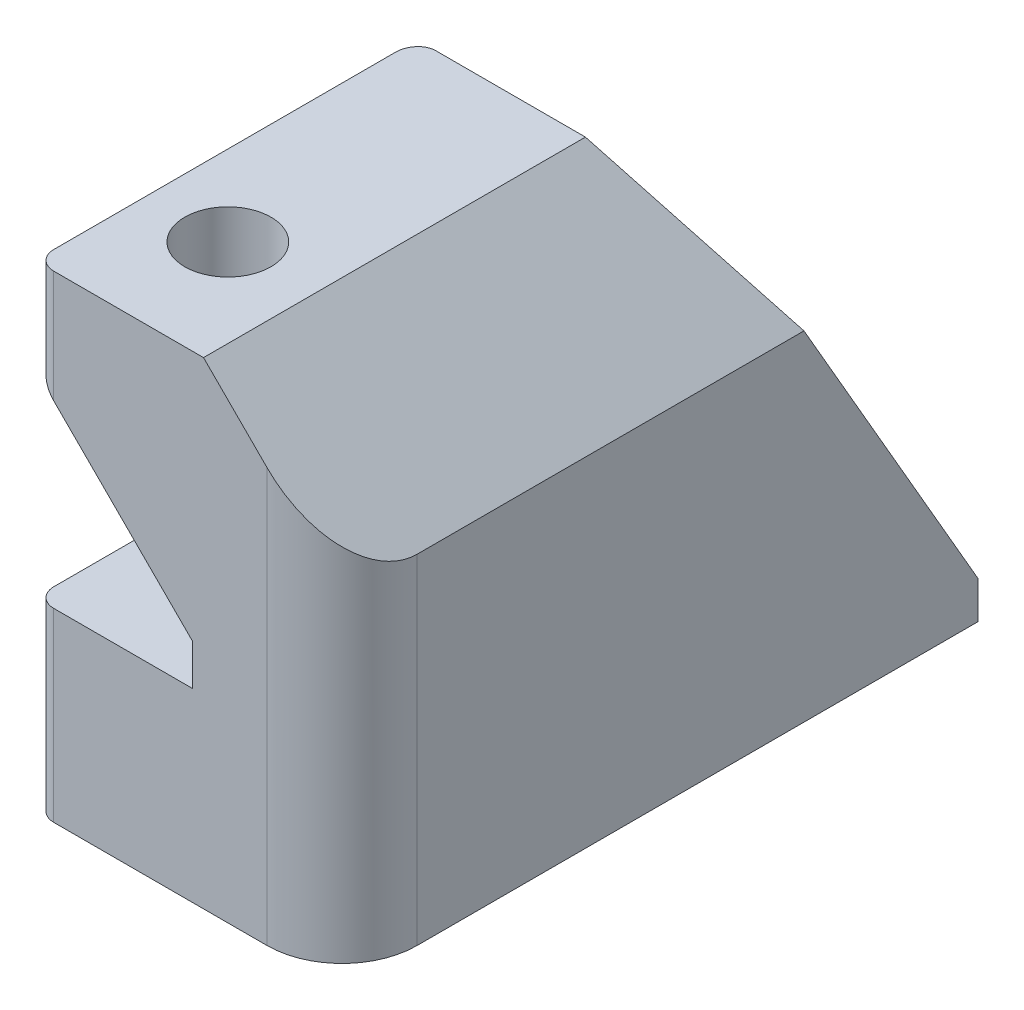
ISO-10303-21;
HEADER;
FILE_DESCRIPTION(('STEP AP214'),'2;1');
FILE_NAME('part.step','',(''),(''),'','','');
FILE_SCHEMA(('AUTOMOTIVE_DESIGN { 1 0 10303 214 1 1 1 1 }'));
ENDSEC;
DATA;
#1=APPLICATION_CONTEXT('core data for automotive mechanical design processes');
#2=APPLICATION_PROTOCOL_DEFINITION('international standard','automotive_design',2000,#1);
#3=PRODUCT_CONTEXT('',#1,'mechanical');
#4=PRODUCT('Part','Part','',(#3));
#5=PRODUCT_RELATED_PRODUCT_CATEGORY('part','',(#4));
#6=PRODUCT_DEFINITION_FORMATION('','',#4);
#7=PRODUCT_DEFINITION_CONTEXT('part definition',#1,'design');
#8=PRODUCT_DEFINITION('design','',#6,#7);
#9=PRODUCT_DEFINITION_SHAPE('','',#8);
#10=(LENGTH_UNIT() NAMED_UNIT(*) SI_UNIT(.MILLI.,.METRE.));
#11=(NAMED_UNIT(*) PLANE_ANGLE_UNIT() SI_UNIT($,.RADIAN.));
#12=(NAMED_UNIT(*) SI_UNIT($,.STERADIAN.) SOLID_ANGLE_UNIT());
#13=UNCERTAINTY_MEASURE_WITH_UNIT(LENGTH_MEASURE(1.E-05),#10,'distance_accuracy_value','');
#14=(GEOMETRIC_REPRESENTATION_CONTEXT(3) GLOBAL_UNCERTAINTY_ASSIGNED_CONTEXT((#13)) GLOBAL_UNIT_ASSIGNED_CONTEXT((#10,
#11,#12)) REPRESENTATION_CONTEXT('',''));
#15=CARTESIAN_POINT('',(0.,0.,0.));
#16=DIRECTION('',(0.,0.,1.));
#17=DIRECTION('',(1.,0.,0.));
#18=AXIS2_PLACEMENT_3D('',#15,#16,#17);
#19=CARTESIAN_POINT('',(0.,0.,-46.39999966));
#20=DIRECTION('',(0.,-1.,0.));
#21=DIRECTION('',(0.,0.,-1.));
#22=AXIS2_PLACEMENT_3D('',#19,#20,#21);
#23=PLANE('',#22);
#24=CARTESIAN_POINT('',(22.3,0.,-15.4065152237886));
#25=DIRECTION('',(0.,-1.,0.));
#26=DIRECTION('',(0.,0.,-1.));
#27=AXIS2_PLACEMENT_3D('',#24,#25,#26);
#28=ELLIPSE('',#27,0.577350269189628,0.5);
#29=CARTESIAN_POINT('',(22.3,0.,-15.9838654929782));
#30=VERTEX_POINT('',#29);
#31=CARTESIAN_POINT('',(21.8,0.,-15.4065152237886));
#32=VERTEX_POINT('',#31);
#33=EDGE_CURVE('E69',#30,#32,#28,.F.);
#34=ORIENTED_EDGE('',*,*,#33,.F.);
#35=DIRECTION('',(-1.,0.,0.));
#36=VECTOR('',#35,1.);
#37=CARTESIAN_POINT('',(0.,0.,-15.9838654929782));
#38=LINE('',#37,#36);
#39=CARTESIAN_POINT('',(30.,0.,-15.9838654929782));
#40=VERTEX_POINT('',#39);
#41=EDGE_CURVE('E182',#40,#30,#38,.T.);
#42=ORIENTED_EDGE('',*,*,#41,.F.);
#43=DIRECTION('',(0.,0.,1.));
#44=VECTOR('',#43,1.);
#45=CARTESIAN_POINT('',(30.,0.,-46.39999966));
#46=LINE('',#45,#44);
#47=CARTESIAN_POINT('',(30.,0.,-1.));
#48=VERTEX_POINT('',#47);
#49=EDGE_CURVE('E237',#40,#48,#46,.T.);
#50=ORIENTED_EDGE('',*,*,#49,.T.);
#51=CARTESIAN_POINT('',(28.,0.,-1.));
#52=DIRECTION('',(0.,-1.,0.));
#53=DIRECTION('',(0.,0.,-1.));
#54=AXIS2_PLACEMENT_3D('',#51,#52,#53);
#55=CIRCLE('',#54,2.);
#56=CARTESIAN_POINT('',(28.,0.,1.));
#57=VERTEX_POINT('',#56);
#58=EDGE_CURVE('E194',#48,#57,#55,.T.);
#59=ORIENTED_EDGE('',*,*,#58,.T.);
#60=DIRECTION('',(1.,0.,0.));
#61=VECTOR('',#60,1.);
#62=CARTESIAN_POINT('',(0.,0.,1.));
#63=LINE('',#62,#61);
#64=CARTESIAN_POINT('',(22.3,0.,1.));
#65=VERTEX_POINT('',#64);
#66=EDGE_CURVE('E40',#65,#57,#63,.T.);
#67=ORIENTED_EDGE('',*,*,#66,.F.);
#68=CARTESIAN_POINT('',(22.3,0.,0.5));
#69=DIRECTION('',(0.,-1.,0.));
#70=DIRECTION('',(0.,0.,-1.));
#71=AXIS2_PLACEMENT_3D('',#68,#69,#70);
#72=CIRCLE('',#71,0.5);
#73=CARTESIAN_POINT('',(21.8,0.,0.5));
#74=VERTEX_POINT('',#73);
#75=EDGE_CURVE('E12',#74,#65,#72,.F.);
#76=ORIENTED_EDGE('',*,*,#75,.F.);
#77=DIRECTION('',(0.,0.,1.));
#78=VECTOR('',#77,1.);
#79=CARTESIAN_POINT('',(21.8,0.,-46.39999966));
#80=LINE('',#79,#78);
#81=EDGE_CURVE('E46',#32,#74,#80,.T.);
#82=ORIENTED_EDGE('',*,*,#81,.F.);
#83=EDGE_LOOP('',(#34,#42,#50,#59,#67,#76,#82));
#84=FACE_BOUND('',#83,.T.);
#85=CARTESIAN_POINT('',(23.9499998314252,0.,-2.00000000000001));
#86=DIRECTION('',(0.,1.,0.));
#87=DIRECTION('',(0.,0.,1.));
#88=AXIS2_PLACEMENT_3D('',#85,#86,#87);
#89=CIRCLE('',#88,1.15);
#90=CARTESIAN_POINT('',(23.9499998314252,0.,-0.850000000000011));
#91=VERTEX_POINT('',#90);
#92=EDGE_CURVE('E191',#91,#91,#89,.T.);
#93=ORIENTED_EDGE('',*,*,#92,.T.);
#94=EDGE_LOOP('',(#93));
#95=FACE_BOUND('',#94,.T.);
#96=ADVANCED_FACE('F37',(#84,#95),#23,.T.);
#97=CARTESIAN_POINT('',(0.,0.,1.));
#98=DIRECTION('',(0.,0.,1.));
#99=DIRECTION('',(1.,0.,0.));
#100=AXIS2_PLACEMENT_3D('',#97,#98,#99);
#101=PLANE('',#100);
#102=DIRECTION('',(0.,-1.,0.));
#103=VECTOR('',#102,1.);
#104=CARTESIAN_POINT('',(22.3,0.,1.));
#105=LINE('',#104,#103);
#106=CARTESIAN_POINT('',(22.3,4.95,1.));
#107=VERTEX_POINT('',#106);
#108=EDGE_CURVE('E55',#107,#65,#105,.T.);
#109=ORIENTED_EDGE('',*,*,#108,.T.);
#110=ORIENTED_EDGE('',*,*,#66,.T.);
#111=DIRECTION('',(0.,1.,0.));
#112=VECTOR('',#111,1.);
#113=CARTESIAN_POINT('',(28.,0.,1.));
#114=LINE('',#113,#112);
#115=CARTESIAN_POINT('',(28.,11.05,1.));
#116=VERTEX_POINT('',#115);
#117=EDGE_CURVE('E218',#57,#116,#114,.T.);
#118=ORIENTED_EDGE('',*,*,#117,.T.);
#119=DIRECTION('',(0.707106781186548,-0.707106781186548,0.));
#120=VECTOR('',#119,1.);
#121=CARTESIAN_POINT('',(26.3,12.75,1.));
#122=LINE('',#121,#120);
#123=CARTESIAN_POINT('',(26.3,12.75,1.));
#124=VERTEX_POINT('',#123);
#125=EDGE_CURVE('E186',#124,#116,#122,.T.);
#126=ORIENTED_EDGE('',*,*,#125,.F.);
#127=DIRECTION('',(-1.,0.,0.));
#128=VECTOR('',#127,1.);
#129=CARTESIAN_POINT('',(0.,12.75,1.));
#130=LINE('',#129,#128);
#131=CARTESIAN_POINT('',(22.3,12.75,1.));
#132=VERTEX_POINT('',#131);
#133=EDGE_CURVE('E215',#124,#132,#130,.T.);
#134=ORIENTED_EDGE('',*,*,#133,.T.);
#135=DIRECTION('',(0.,-1.,0.));
#136=VECTOR('',#135,1.);
#137=CARTESIAN_POINT('',(22.3,0.,1.));
#138=LINE('',#137,#136);
#139=CARTESIAN_POINT('',(22.3,9.74999999999999,1.));
#140=VERTEX_POINT('',#139);
#141=EDGE_CURVE('E214',#132,#140,#138,.T.);
#142=ORIENTED_EDGE('',*,*,#141,.T.);
#143=DIRECTION('',(0.707106781186549,-0.707106781186547,0.));
#144=VECTOR('',#143,1.);
#145=CARTESIAN_POINT('',(16.025,16.025,1.));
#146=LINE('',#145,#144);
#147=CARTESIAN_POINT('',(26.,6.05,1.));
#148=VERTEX_POINT('',#147);
#149=EDGE_CURVE('E212',#140,#148,#146,.T.);
#150=ORIENTED_EDGE('',*,*,#149,.T.);
#151=DIRECTION('',(0.,-1.,0.));
#152=VECTOR('',#151,1.);
#153=CARTESIAN_POINT('',(26.,0.,1.));
#154=LINE('',#153,#152);
#155=CARTESIAN_POINT('',(26.,4.95,1.));
#156=VERTEX_POINT('',#155);
#157=EDGE_CURVE('E209',#148,#156,#154,.T.);
#158=ORIENTED_EDGE('',*,*,#157,.T.);
#159=DIRECTION('',(-1.,0.,0.));
#160=VECTOR('',#159,1.);
#161=CARTESIAN_POINT('',(0.,4.94999999999999,1.));
#162=LINE('',#161,#160);
#163=EDGE_CURVE('E206',#156,#107,#162,.T.);
#164=ORIENTED_EDGE('',*,*,#163,.T.);
#165=EDGE_LOOP('',(#109,#110,#118,#126,#134,#142,#150,#158,#164));
#166=FACE_BOUND('',#165,.T.);
#167=ADVANCED_FACE('F285',(#166),#101,.T.);
#168=CARTESIAN_POINT('',(21.8,4.95,-46.39999966));
#169=DIRECTION('',(-1.,0.,0.));
#170=DIRECTION('',(0.,0.,1.));
#171=AXIS2_PLACEMENT_3D('',#168,#169,#170);
#172=PLANE('',#171);
#173=DIRECTION('',(0.,0.866025403784436,0.500000000000005));
#174=VECTOR('',#173,1.);
#175=CARTESIAN_POINT('',(21.8,0.749999999999996,-15.550852791086));
#176=LINE('',#175,#174);
#177=CARTESIAN_POINT('',(21.8,4.95,-13.1259816604895));
#178=VERTEX_POINT('',#177);
#179=CARTESIAN_POINT('',(21.8,1.,-15.4065152237886));
#180=VERTEX_POINT('',#179);
#181=EDGE_CURVE('E158',#178,#180,#176,.F.);
#182=ORIENTED_EDGE('',*,*,#181,.T.);
#183=DIRECTION('',(0.,1.,0.));
#184=VECTOR('',#183,1.);
#185=CARTESIAN_POINT('',(21.8,-9.,-15.4065152237886));
#186=LINE('',#185,#184);
#187=EDGE_CURVE('E265',#32,#180,#186,.T.);
#188=ORIENTED_EDGE('',*,*,#187,.F.);
#189=ORIENTED_EDGE('',*,*,#81,.T.);
#190=DIRECTION('',(0.,-1.,0.));
#191=VECTOR('',#190,1.);
#192=CARTESIAN_POINT('',(21.8,4.95,0.5));
#193=LINE('',#192,#191);
#194=CARTESIAN_POINT('',(21.8,4.95,0.5));
#195=VERTEX_POINT('',#194);
#196=EDGE_CURVE('E208',#74,#195,#193,.F.);
#197=ORIENTED_EDGE('',*,*,#196,.T.);
#198=DIRECTION('',(0.,0.,1.));
#199=VECTOR('',#198,1.);
#200=CARTESIAN_POINT('',(21.8,4.95,-46.39999966));
#201=LINE('',#200,#199);
#202=EDGE_CURVE('E233',#178,#195,#201,.T.);
#203=ORIENTED_EDGE('',*,*,#202,.F.);
#204=EDGE_LOOP('',(#182,#188,#189,#197,#203));
#205=FACE_BOUND('',#204,.T.);
#206=ADVANCED_FACE('F287',(#205),#172,.T.);
#207=CARTESIAN_POINT('',(26.,4.95,-46.39999966));
#208=DIRECTION('',(0.,1.,0.));
#209=DIRECTION('',(-1.,0.,0.));
#210=AXIS2_PLACEMENT_3D('',#207,#208,#209);
#211=PLANE('',#210);
#212=ORIENTED_EDGE('',*,*,#202,.T.);
#213=CARTESIAN_POINT('',(22.3,4.95,0.5));
#214=DIRECTION('',(0.,1.,0.));
#215=DIRECTION('',(-1.,0.,0.));
#216=AXIS2_PLACEMENT_3D('',#213,#214,#215);
#217=CIRCLE('',#216,0.5);
#218=EDGE_CURVE('E164',#195,#107,#217,.T.);
#219=ORIENTED_EDGE('',*,*,#218,.T.);
#220=ORIENTED_EDGE('',*,*,#163,.F.);
#221=DIRECTION('',(0.,0.,1.));
#222=VECTOR('',#221,1.);
#223=CARTESIAN_POINT('',(26.,4.95,-46.39999966));
#224=LINE('',#223,#222);
#225=CARTESIAN_POINT('',(26.,4.95,-13.7033319296791));
#226=VERTEX_POINT('',#225);
#227=EDGE_CURVE('E163',#226,#156,#224,.T.);
#228=ORIENTED_EDGE('',*,*,#227,.F.);
#229=DIRECTION('',(1.,0.,0.));
#230=VECTOR('',#229,1.);
#231=CARTESIAN_POINT('',(26.,4.95,-13.7033319296791));
#232=LINE('',#231,#230);
#233=CARTESIAN_POINT('',(22.3,4.95,-13.7033319296791));
#234=VERTEX_POINT('',#233);
#235=EDGE_CURVE('E170',#234,#226,#232,.T.);
#236=ORIENTED_EDGE('',*,*,#235,.F.);
#237=CARTESIAN_POINT('',(22.3,4.95,-13.1259816604895));
#238=DIRECTION('',(0.,1.,0.));
#239=DIRECTION('',(0.,0.,-1.));
#240=AXIS2_PLACEMENT_3D('',#237,#238,#239);
#241=ELLIPSE('',#240,0.577350269189627,0.5);
#242=EDGE_CURVE('E152',#234,#178,#241,.T.);
#243=ORIENTED_EDGE('',*,*,#242,.T.);
#244=EDGE_LOOP('',(#212,#219,#220,#228,#236,#243));
#245=FACE_BOUND('',#244,.T.);
#246=CARTESIAN_POINT('',(23.9499998314252,4.95,-2.00000000000001));
#247=DIRECTION('',(0.,1.,0.));
#248=DIRECTION('',(-1.,0.,0.));
#249=AXIS2_PLACEMENT_3D('',#246,#247,#248);
#250=CIRCLE('',#249,1.15);
#251=CARTESIAN_POINT('',(22.7999998314252,4.95,-2.00000000000001));
#252=VERTEX_POINT('',#251);
#253=EDGE_CURVE('E202',#252,#252,#250,.T.);
#254=ORIENTED_EDGE('',*,*,#253,.F.);
#255=EDGE_LOOP('',(#254));
#256=FACE_BOUND('',#255,.T.);
#257=ADVANCED_FACE('F177',(#245,#256),#211,.T.);
#258=CARTESIAN_POINT('',(26.,6.05,-46.39999966));
#259=DIRECTION('',(-1.,0.,0.));
#260=DIRECTION('',(0.,0.,1.));
#261=AXIS2_PLACEMENT_3D('',#258,#259,#260);
#262=PLANE('',#261);
#263=DIRECTION('',(0.,0.866025403784436,0.500000000000005));
#264=VECTOR('',#263,1.);
#265=CARTESIAN_POINT('',(26.,-8.38307243677847,-21.4011848901781));
#266=LINE('',#265,#264);
#267=CARTESIAN_POINT('',(26.,6.05,-13.0682466335705));
#268=VERTEX_POINT('',#267);
#269=EDGE_CURVE('E180',#226,#268,#266,.T.);
#270=ORIENTED_EDGE('',*,*,#269,.F.);
#271=ORIENTED_EDGE('',*,*,#227,.T.);
#272=ORIENTED_EDGE('',*,*,#157,.F.);
#273=DIRECTION('',(0.,0.,1.));
#274=VECTOR('',#273,1.);
#275=CARTESIAN_POINT('',(26.,6.05,-46.39999966));
#276=LINE('',#275,#274);
#277=EDGE_CURVE('E232',#268,#148,#276,.T.);
#278=ORIENTED_EDGE('',*,*,#277,.F.);
#279=EDGE_LOOP('',(#270,#271,#272,#278));
#280=FACE_BOUND('',#279,.T.);
#281=ADVANCED_FACE('F377',(#280),#262,.T.);
#282=CARTESIAN_POINT('',(22.3,9.74999999999999,-46.39999966));
#283=DIRECTION('',(-0.707106781186546,-0.707106781186548,0.));
#284=DIRECTION('',(0.707106781186549,-0.707106781186547,0.));
#285=AXIS2_PLACEMENT_3D('',#282,#283,#284);
#286=PLANE('',#285);
#287=ORIENTED_EDGE('',*,*,#149,.F.);
#288=CARTESIAN_POINT('',(22.3,9.74999999999999,0.5));
#289=DIRECTION('',(-0.707106781186546,-0.707106781186548,0.));
#290=DIRECTION('',(0.707106781186549,-0.707106781186547,0.));
#291=AXIS2_PLACEMENT_3D('',#288,#289,#290);
#292=ELLIPSE('',#291,0.707106781186547,0.5);
#293=CARTESIAN_POINT('',(21.8,10.25,0.5));
#294=VERTEX_POINT('',#293);
#295=EDGE_CURVE('E249',#140,#294,#292,.T.);
#296=ORIENTED_EDGE('',*,*,#295,.T.);
#297=DIRECTION('',(0.,0.,1.));
#298=VECTOR('',#297,1.);
#299=CARTESIAN_POINT('',(21.8,10.25,-46.39999966));
#300=LINE('',#299,#298);
#301=CARTESIAN_POINT('',(21.8,10.25,-10.0660252337845));
#302=VERTEX_POINT('',#301);
#303=EDGE_CURVE('E228',#302,#294,#300,.T.);
#304=ORIENTED_EDGE('',*,*,#303,.F.);
#305=CARTESIAN_POINT('',(22.3,9.74999999999999,-10.3547003683793));
#306=DIRECTION('',(-0.707106781186546,-0.707106781186548,0.));
#307=DIRECTION('',(0.547722557505164,-0.547722557505162,-0.632455532033681));
#308=AXIS2_PLACEMENT_3D('',#305,#306,#307);
#309=ELLIPSE('',#308,0.816496580927727,0.5);
#310=CARTESIAN_POINT('',(22.3,9.74999999999999,-10.9320506375689));
#311=VERTEX_POINT('',#310);
#312=EDGE_CURVE('E247',#302,#311,#309,.T.);
#313=ORIENTED_EDGE('',*,*,#312,.T.);
#314=DIRECTION('',(-0.654653670707977,0.654653670707975,0.377964473009231));
#315=VECTOR('',#314,1.);
#316=CARTESIAN_POINT('',(31.0760413924449,0.97395860755514,-15.9989004979163));
#317=LINE('',#316,#315);
#318=EDGE_CURVE('E198',#268,#311,#317,.T.);
#319=ORIENTED_EDGE('',*,*,#318,.F.);
#320=ORIENTED_EDGE('',*,*,#277,.T.);
#321=EDGE_LOOP('',(#287,#296,#304,#313,#319,#320));
#322=FACE_BOUND('',#321,.T.);
#323=CARTESIAN_POINT('',(23.9499998314252,8.10000016857482,-2.00000000000001));
#324=DIRECTION('',(-0.707106781186546,-0.707106781186548,0.));
#325=DIRECTION('',(-0.707106781186549,0.707106781186547,0.));
#326=AXIS2_PLACEMENT_3D('',#323,#324,#325);
#327=ELLIPSE('',#326,1.62634559672906,1.15);
#328=CARTESIAN_POINT('',(22.7999998314252,9.25000016857482,-2.00000000000001));
#329=VERTEX_POINT('',#328);
#330=EDGE_CURVE('E199',#329,#329,#327,.T.);
#331=ORIENTED_EDGE('',*,*,#330,.F.);
#332=EDGE_LOOP('',(#331));
#333=FACE_BOUND('',#332,.T.);
#334=ADVANCED_FACE('F341',(#322,#333),#286,.T.);
#335=CARTESIAN_POINT('',(21.8,12.75,-46.39999966));
#336=DIRECTION('',(-1.,0.,0.));
#337=DIRECTION('',(0.,0.,1.));
#338=AXIS2_PLACEMENT_3D('',#335,#336,#337);
#339=PLANE('',#338);
#340=ORIENTED_EDGE('',*,*,#303,.T.);
#341=DIRECTION('',(0.,-1.,0.));
#342=VECTOR('',#341,1.);
#343=CARTESIAN_POINT('',(21.8,12.75,0.5));
#344=LINE('',#343,#342);
#345=CARTESIAN_POINT('',(21.8,12.75,0.5));
#346=VERTEX_POINT('',#345);
#347=EDGE_CURVE('E231',#294,#346,#344,.F.);
#348=ORIENTED_EDGE('',*,*,#347,.T.);
#349=DIRECTION('',(0.,0.,1.));
#350=VECTOR('',#349,1.);
#351=CARTESIAN_POINT('',(21.8,12.75,-46.39999966));
#352=LINE('',#351,#350);
#353=CARTESIAN_POINT('',(21.8,12.75,-8.62264956081037));
#354=VERTEX_POINT('',#353);
#355=EDGE_CURVE('E223',#354,#346,#352,.T.);
#356=ORIENTED_EDGE('',*,*,#355,.F.);
#357=DIRECTION('',(0.,0.866025403784436,0.500000000000005));
#358=VECTOR('',#357,1.);
#359=CARTESIAN_POINT('',(21.8,9.99999999999999,-10.2103628010819));
#360=LINE('',#359,#358);
#361=EDGE_CURVE('E227',#354,#302,#360,.F.);
#362=ORIENTED_EDGE('',*,*,#361,.T.);
#363=EDGE_LOOP('',(#340,#348,#356,#362));
#364=FACE_BOUND('',#363,.T.);
#365=ADVANCED_FACE('F316',(#364),#339,.T.);
#366=CARTESIAN_POINT('',(30.,12.75,-46.39999966));
#367=DIRECTION('',(0.,1.,0.));
#368=DIRECTION('',(0.,0.,1.));
#369=AXIS2_PLACEMENT_3D('',#366,#367,#368);
#370=PLANE('',#369);
#371=ORIENTED_EDGE('',*,*,#355,.T.);
#372=CARTESIAN_POINT('',(22.3,12.75,0.5));
#373=DIRECTION('',(0.,1.,0.));
#374=DIRECTION('',(0.,0.,1.));
#375=AXIS2_PLACEMENT_3D('',#372,#373,#374);
#376=CIRCLE('',#375,0.5);
#377=EDGE_CURVE('E226',#346,#132,#376,.T.);
#378=ORIENTED_EDGE('',*,*,#377,.T.);
#379=ORIENTED_EDGE('',*,*,#133,.F.);
#380=DIRECTION('',(0.,0.,1.));
#381=VECTOR('',#380,1.);
#382=CARTESIAN_POINT('',(26.3,12.75,-47.39999966));
#383=LINE('',#382,#381);
#384=CARTESIAN_POINT('',(26.3,12.75,-9.19999983));
#385=VERTEX_POINT('',#384);
#386=EDGE_CURVE('E222',#385,#124,#383,.T.);
#387=ORIENTED_EDGE('',*,*,#386,.F.);
#388=DIRECTION('',(1.,0.,0.));
#389=VECTOR('',#388,1.);
#390=CARTESIAN_POINT('',(-30.,12.75,-9.19999983));
#391=LINE('',#390,#389);
#392=CARTESIAN_POINT('',(22.3,12.75,-9.19999983));
#393=VERTEX_POINT('',#392);
#394=EDGE_CURVE('E261',#393,#385,#391,.T.);
#395=ORIENTED_EDGE('',*,*,#394,.F.);
#396=CARTESIAN_POINT('',(22.3,12.75,-8.62264956081037));
#397=DIRECTION('',(0.,1.,0.));
#398=DIRECTION('',(0.,0.,-1.));
#399=AXIS2_PLACEMENT_3D('',#396,#397,#398);
#400=ELLIPSE('',#399,0.577350269189627,0.5);
#401=EDGE_CURVE('E190',#393,#354,#400,.T.);
#402=ORIENTED_EDGE('',*,*,#401,.T.);
#403=EDGE_LOOP('',(#371,#378,#379,#387,#395,#402));
#404=FACE_BOUND('',#403,.T.);
#405=CARTESIAN_POINT('',(23.9499998314252,12.75,-2.00000000000001));
#406=DIRECTION('',(0.,1.,0.));
#407=DIRECTION('',(0.,0.,1.));
#408=AXIS2_PLACEMENT_3D('',#405,#406,#407);
#409=CIRCLE('',#408,1.15);
#410=CARTESIAN_POINT('',(23.9499998314252,12.75,-0.850000000000011));
#411=VERTEX_POINT('',#410);
#412=EDGE_CURVE('E195',#411,#411,#409,.T.);
#413=ORIENTED_EDGE('',*,*,#412,.F.);
#414=EDGE_LOOP('',(#413));
#415=FACE_BOUND('',#414,.T.);
#416=ADVANCED_FACE('F364',(#404,#415),#370,.T.);
#417=CARTESIAN_POINT('',(26.3,12.75,-47.39999966));
#418=DIRECTION('',(-0.707106781186547,-0.707106781186547,0.));
#419=DIRECTION('',(0.707106781186548,-0.707106781186548,0.));
#420=AXIS2_PLACEMENT_3D('',#417,#418,#419);
#421=PLANE('',#420);
#422=ORIENTED_EDGE('',*,*,#125,.T.);
#423=CARTESIAN_POINT('',(28.,11.05,-1.));
#424=DIRECTION('',(-0.707106781186547,-0.707106781186547,0.));
#425=DIRECTION('',(-0.707106781186548,0.707106781186548,0.));
#426=AXIS2_PLACEMENT_3D('',#423,#424,#425);
#427=ELLIPSE('',#426,2.82842712474619,2.);
#428=CARTESIAN_POINT('',(30.,9.04999999999999,-1.00000000000001));
#429=VERTEX_POINT('',#428);
#430=EDGE_CURVE('E189',#116,#429,#427,.F.);
#431=ORIENTED_EDGE('',*,*,#430,.T.);
#432=DIRECTION('',(0.,0.,1.));
#433=VECTOR('',#432,1.);
#434=CARTESIAN_POINT('',(30.,9.04999999999999,-47.39999966));
#435=LINE('',#434,#433);
#436=CARTESIAN_POINT('',(30.,9.04999999999999,-11.3361958260016));
#437=VERTEX_POINT('',#436);
#438=EDGE_CURVE('E243',#437,#429,#435,.T.);
#439=ORIENTED_EDGE('',*,*,#438,.F.);
#440=DIRECTION('',(-0.654653670707976,0.654653670707976,0.377964473009231));
#441=VECTOR('',#440,1.);
#442=CARTESIAN_POINT('',(35.752048650669,3.29795134933098,-14.6571426628573));
#443=LINE('',#442,#441);
#444=EDGE_CURVE('E219',#437,#385,#443,.T.);
#445=ORIENTED_EDGE('',*,*,#444,.T.);
#446=ORIENTED_EDGE('',*,*,#386,.T.);
#447=EDGE_LOOP('',(#422,#431,#439,#445,#446));
#448=FACE_BOUND('',#447,.T.);
#449=ADVANCED_FACE('F311',(#448),#421,.F.);
#450=CARTESIAN_POINT('',(30.,0.,-46.39999966));
#451=DIRECTION('',(1.,0.,0.));
#452=DIRECTION('',(0.,0.,-1.));
#453=AXIS2_PLACEMENT_3D('',#450,#451,#452);
#454=PLANE('',#453);
#455=DIRECTION('',(0.,1.,0.));
#456=VECTOR('',#455,1.);
#457=CARTESIAN_POINT('',(30.,-9.,-15.9838654929782));
#458=LINE('',#457,#456);
#459=CARTESIAN_POINT('',(30.,1.,-15.9838654929782));
#460=VERTEX_POINT('',#459);
#461=EDGE_CURVE('E78',#40,#460,#458,.T.);
#462=ORIENTED_EDGE('',*,*,#461,.T.);
#463=DIRECTION('',(0.,-0.866025403784436,-0.500000000000005));
#464=VECTOR('',#463,1.);
#465=CARTESIAN_POINT('',(30.,0.999999999999998,-15.9838654929782));
#466=LINE('',#465,#464);
#467=EDGE_CURVE('E174',#437,#460,#466,.T.);
#468=ORIENTED_EDGE('',*,*,#467,.F.);
#469=ORIENTED_EDGE('',*,*,#438,.T.);
#470=DIRECTION('',(0.,1.,0.));
#471=VECTOR('',#470,1.);
#472=CARTESIAN_POINT('',(30.,0.,-1.));
#473=LINE('',#472,#471);
#474=EDGE_CURVE('E205',#429,#48,#473,.F.);
#475=ORIENTED_EDGE('',*,*,#474,.T.);
#476=ORIENTED_EDGE('',*,*,#49,.F.);
#477=EDGE_LOOP('',(#462,#468,#469,#475,#476));
#478=FACE_BOUND('',#477,.T.);
#479=ADVANCED_FACE('F303',(#478),#454,.T.);
#480=CARTESIAN_POINT('',(23.9499998314252,0.,-2.00000000000001));
#481=DIRECTION('',(0.,1.,0.));
#482=DIRECTION('',(0.,0.,1.));
#483=AXIS2_PLACEMENT_3D('',#480,#481,#482);
#484=CYLINDRICAL_SURFACE('',#483,1.15);
#485=ORIENTED_EDGE('',*,*,#253,.T.);
#486=EDGE_LOOP('',(#485));
#487=FACE_BOUND('',#486,.T.);
#488=ORIENTED_EDGE('',*,*,#92,.F.);
#489=EDGE_LOOP('',(#488));
#490=FACE_BOUND('',#489,.T.);
#491=ADVANCED_FACE('F301',(#487,#490),#484,.F.);
#492=ORIENTED_EDGE('',*,*,#330,.T.);
#493=EDGE_LOOP('',(#492));
#494=FACE_BOUND('',#493,.T.);
#495=ORIENTED_EDGE('',*,*,#412,.T.);
#496=EDGE_LOOP('',(#495));
#497=FACE_BOUND('',#496,.T.);
#498=ADVANCED_FACE('F283',(#494,#497),#484,.F.);
#499=CARTESIAN_POINT('',(-30.,0.999999999999998,-15.9838654929782));
#500=DIRECTION('',(0.,-0.500000000000005,0.866025403784436));
#501=DIRECTION('',(0.,-0.866025403784436,-0.500000000000005));
#502=AXIS2_PLACEMENT_3D('',#499,#500,#501);
#503=PLANE('',#502);
#504=ORIENTED_EDGE('',*,*,#318,.T.);
#505=DIRECTION('',(0.,0.866025403784436,0.500000000000005));
#506=VECTOR('',#505,1.);
#507=CARTESIAN_POINT('',(22.3,12.75,-9.19999983));
#508=LINE('',#507,#506);
#509=EDGE_CURVE('E258',#311,#393,#508,.T.);
#510=ORIENTED_EDGE('',*,*,#509,.T.);
#511=ORIENTED_EDGE('',*,*,#394,.T.);
#512=ORIENTED_EDGE('',*,*,#444,.F.);
#513=ORIENTED_EDGE('',*,*,#467,.T.);
#514=DIRECTION('',(1.,0.,0.));
#515=VECTOR('',#514,1.);
#516=CARTESIAN_POINT('',(-30.,0.999999999999998,-15.9838654929782));
#517=LINE('',#516,#515);
#518=CARTESIAN_POINT('',(22.3,1.,-15.9838654929782));
#519=VERTEX_POINT('',#518);
#520=EDGE_CURVE('E173',#519,#460,#517,.T.);
#521=ORIENTED_EDGE('',*,*,#520,.F.);
#522=DIRECTION('',(0.,0.866025403784436,0.500000000000005));
#523=VECTOR('',#522,1.);
#524=CARTESIAN_POINT('',(22.3,4.95,-13.7033319296791));
#525=LINE('',#524,#523);
#526=EDGE_CURVE('E156',#519,#234,#525,.T.);
#527=ORIENTED_EDGE('',*,*,#526,.T.);
#528=ORIENTED_EDGE('',*,*,#235,.T.);
#529=ORIENTED_EDGE('',*,*,#269,.T.);
#530=EDGE_LOOP('',(#504,#510,#511,#512,#513,#521,#527,#528,#529));
#531=FACE_BOUND('',#530,.T.);
#532=ADVANCED_FACE('F169',(#531),#503,.F.);
#533=CARTESIAN_POINT('',(28.,0.,-1.));
#534=DIRECTION('',(0.,1.,0.));
#535=DIRECTION('',(0.,0.,1.));
#536=AXIS2_PLACEMENT_3D('',#533,#534,#535);
#537=CYLINDRICAL_SURFACE('',#536,2.);
#538=ORIENTED_EDGE('',*,*,#58,.F.);
#539=ORIENTED_EDGE('',*,*,#474,.F.);
#540=ORIENTED_EDGE('',*,*,#430,.F.);
#541=ORIENTED_EDGE('',*,*,#117,.F.);
#542=EDGE_LOOP('',(#538,#539,#540,#541));
#543=FACE_BOUND('',#542,.T.);
#544=ADVANCED_FACE('F282',(#543),#537,.T.);
#545=CARTESIAN_POINT('',(22.3,0.,0.5));
#546=DIRECTION('',(0.,-1.,0.));
#547=DIRECTION('',(0.,0.,-1.));
#548=AXIS2_PLACEMENT_3D('',#545,#546,#547);
#549=CYLINDRICAL_SURFACE('',#548,0.5);
#550=ORIENTED_EDGE('',*,*,#377,.F.);
#551=ORIENTED_EDGE('',*,*,#347,.F.);
#552=ORIENTED_EDGE('',*,*,#295,.F.);
#553=ORIENTED_EDGE('',*,*,#141,.F.);
#554=EDGE_LOOP('',(#550,#551,#552,#553));
#555=FACE_BOUND('',#554,.T.);
#556=ADVANCED_FACE('F320',(#555),#549,.T.);
#557=CARTESIAN_POINT('',(22.3,0.,0.5));
#558=DIRECTION('',(0.,-1.,0.));
#559=DIRECTION('',(0.,0.,-1.));
#560=AXIS2_PLACEMENT_3D('',#557,#558,#559);
#561=CYLINDRICAL_SURFACE('',#560,0.5);
#562=ORIENTED_EDGE('',*,*,#218,.F.);
#563=ORIENTED_EDGE('',*,*,#196,.F.);
#564=ORIENTED_EDGE('',*,*,#75,.T.);
#565=ORIENTED_EDGE('',*,*,#108,.F.);
#566=EDGE_LOOP('',(#562,#563,#564,#565));
#567=FACE_BOUND('',#566,.T.);
#568=ADVANCED_FACE('F324',(#567),#561,.T.);
#569=CARTESIAN_POINT('',(22.3,0.749999999999996,-15.550852791086));
#570=DIRECTION('',(0.,-0.866025403784436,-0.500000000000005));
#571=DIRECTION('',(0.,0.500000000000005,-0.866025403784436));
#572=AXIS2_PLACEMENT_3D('',#569,#570,#571);
#573=CYLINDRICAL_SURFACE('',#572,0.5);
#574=ORIENTED_EDGE('',*,*,#312,.F.);
#575=ORIENTED_EDGE('',*,*,#361,.F.);
#576=ORIENTED_EDGE('',*,*,#401,.F.);
#577=ORIENTED_EDGE('',*,*,#509,.F.);
#578=EDGE_LOOP('',(#574,#575,#576,#577));
#579=FACE_BOUND('',#578,.T.);
#580=ADVANCED_FACE('F327',(#579),#573,.T.);
#581=CARTESIAN_POINT('',(22.3,0.749999999999996,-15.550852791086));
#582=DIRECTION('',(0.,-0.866025403784436,-0.500000000000005));
#583=DIRECTION('',(0.,0.500000000000005,-0.866025403784436));
#584=AXIS2_PLACEMENT_3D('',#581,#582,#583);
#585=CYLINDRICAL_SURFACE('',#584,0.5);
#586=CARTESIAN_POINT('',(22.3,1.,-15.4065152237886));
#587=DIRECTION('',(0.,1.,0.));
#588=DIRECTION('',(0.,0.,-1.));
#589=AXIS2_PLACEMENT_3D('',#586,#587,#588);
#590=ELLIPSE('',#589,0.577350269189627,0.5);
#591=EDGE_CURVE('E262',#180,#519,#590,.F.);
#592=ORIENTED_EDGE('',*,*,#591,.F.);
#593=ORIENTED_EDGE('',*,*,#181,.F.);
#594=ORIENTED_EDGE('',*,*,#242,.F.);
#595=ORIENTED_EDGE('',*,*,#526,.F.);
#596=EDGE_LOOP('',(#592,#593,#594,#595));
#597=FACE_BOUND('',#596,.T.);
#598=ADVANCED_FACE('F155',(#597),#585,.T.);
#599=CARTESIAN_POINT('',(-30.,-9.,-15.9838654929782));
#600=DIRECTION('',(0.,0.,1.));
#601=DIRECTION('',(1.,0.,0.));
#602=AXIS2_PLACEMENT_3D('',#599,#600,#601);
#603=PLANE('',#602);
#604=ORIENTED_EDGE('',*,*,#41,.T.);
#605=DIRECTION('',(0.,1.,0.));
#606=VECTOR('',#605,1.);
#607=CARTESIAN_POINT('',(22.3,-9.,-15.9838654929782));
#608=LINE('',#607,#606);
#609=EDGE_CURVE('E355',#30,#519,#608,.T.);
#610=ORIENTED_EDGE('',*,*,#609,.T.);
#611=ORIENTED_EDGE('',*,*,#520,.T.);
#612=ORIENTED_EDGE('',*,*,#461,.F.);
#613=EDGE_LOOP('',(#604,#610,#611,#612));
#614=FACE_BOUND('',#613,.T.);
#615=ADVANCED_FACE('F278',(#614),#603,.F.);
#616=CARTESIAN_POINT('',(22.3,-9.,-15.4065152237886));
#617=DIRECTION('',(0.,-1.,0.));
#618=DIRECTION('',(0.,0.,-1.));
#619=AXIS2_PLACEMENT_3D('',#616,#617,#618);
#620=ELLIPSE('',#619,0.577350269189628,0.5);
#621=DIRECTION('',(0.,1.,0.));
#622=VECTOR('',#621,1.);
#623=SURFACE_OF_LINEAR_EXTRUSION('',#620,#622);
#624=ORIENTED_EDGE('',*,*,#33,.T.);
#625=ORIENTED_EDGE('',*,*,#187,.T.);
#626=ORIENTED_EDGE('',*,*,#591,.T.);
#627=ORIENTED_EDGE('',*,*,#609,.F.);
#628=EDGE_LOOP('',(#624,#625,#626,#627));
#629=FACE_BOUND('',#628,.T.);
#630=ADVANCED_FACE('F274',(#629),#623,.F.);
#631=CLOSED_SHELL('',(#96,#167,#206,#257,#281,#334,#365,#416,#449,#479,#491,#498,#532,#544,#556,
#568,#580,#598,#615,#630));
#632=MANIFOLD_SOLID_BREP('B2',#631);
#633=ADVANCED_BREP_SHAPE_REPRESENTATION('',(#18,#632),#14);
#634=SHAPE_DEFINITION_REPRESENTATION(#9,#633);
ENDSEC;
END-ISO-10303-21;
